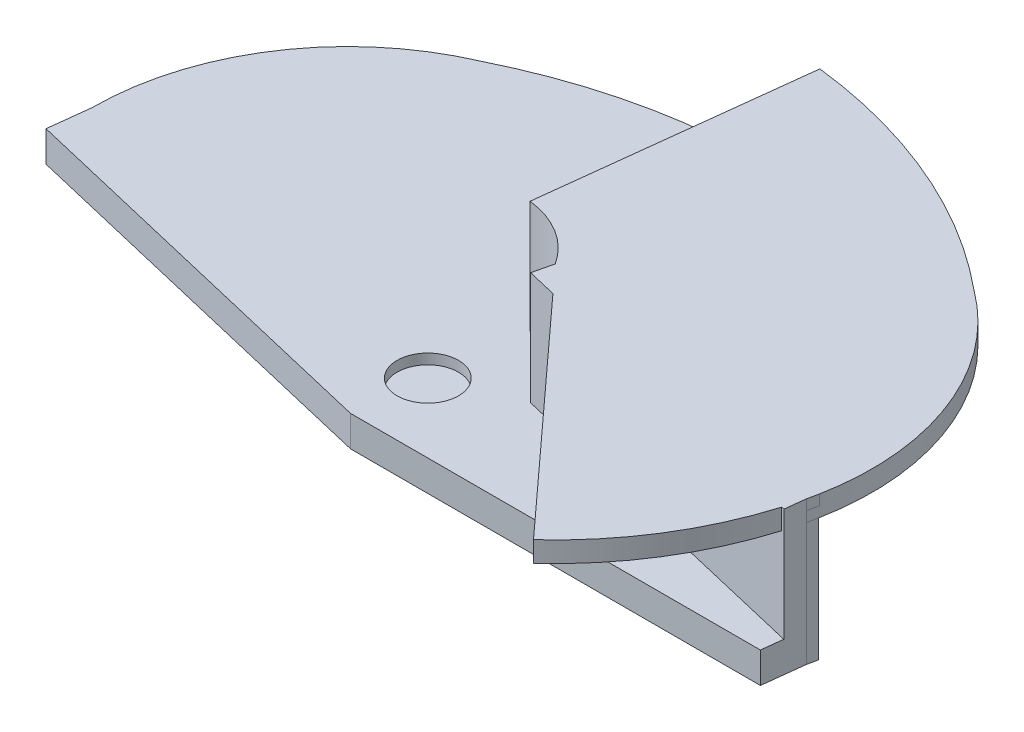
ISO-10303-21;
HEADER;
FILE_DESCRIPTION(('STEP AP214'),'2;1');
FILE_NAME('part.step','',(''),(''),'','','');
FILE_SCHEMA(('AUTOMOTIVE_DESIGN { 1 0 10303 214 1 1 1 1 }'));
ENDSEC;
DATA;
#1=APPLICATION_CONTEXT('core data for automotive mechanical design processes');
#2=APPLICATION_PROTOCOL_DEFINITION('international standard','automotive_design',2000,#1);
#3=PRODUCT_CONTEXT('',#1,'mechanical');
#4=PRODUCT('Part','Part','',(#3));
#5=PRODUCT_RELATED_PRODUCT_CATEGORY('part','',(#4));
#6=PRODUCT_DEFINITION_FORMATION('','',#4);
#7=PRODUCT_DEFINITION_CONTEXT('part definition',#1,'design');
#8=PRODUCT_DEFINITION('design','',#6,#7);
#9=PRODUCT_DEFINITION_SHAPE('','',#8);
#10=(LENGTH_UNIT() NAMED_UNIT(*) SI_UNIT(.MILLI.,.METRE.));
#11=(NAMED_UNIT(*) PLANE_ANGLE_UNIT() SI_UNIT($,.RADIAN.));
#12=(NAMED_UNIT(*) SI_UNIT($,.STERADIAN.) SOLID_ANGLE_UNIT());
#13=UNCERTAINTY_MEASURE_WITH_UNIT(LENGTH_MEASURE(1.E-05),#10,'distance_accuracy_value','');
#14=(GEOMETRIC_REPRESENTATION_CONTEXT(3) GLOBAL_UNCERTAINTY_ASSIGNED_CONTEXT((#13)) GLOBAL_UNIT_ASSIGNED_CONTEXT((#10,
#11,#12)) REPRESENTATION_CONTEXT('',''));
#15=CARTESIAN_POINT('',(0.,0.,0.));
#16=DIRECTION('',(0.,0.,1.));
#17=DIRECTION('',(1.,0.,0.));
#18=AXIS2_PLACEMENT_3D('',#15,#16,#17);
#19=CARTESIAN_POINT('',(43.6601532391621,5.,-13.1517701172031));
#20=DIRECTION('',(0.,1.,0.));
#21=DIRECTION('',(-1.,0.,0.));
#22=AXIS2_PLACEMENT_3D('',#19,#20,#21);
#23=PLANE('',#22);
#24=CARTESIAN_POINT('',(27.3280369120115,5.,1.73227452102643));
#25=DIRECTION('',(0.,1.,0.));
#26=DIRECTION('',(0.981619167562047,0.,0.190850228909461));
#27=AXIS2_PLACEMENT_3D('',#24,#25,#26);
#28=CIRCLE('',#27,12.47);
#29=CARTESIAN_POINT('',(39.5684174931939,5.,4.11208922213855));
#30=VERTEX_POINT('',#29);
#31=CARTESIAN_POINT('',(39.5767492396807,5.,4.07106615646638));
#32=VERTEX_POINT('',#31);
#33=EDGE_CURVE('E52',#30,#32,#28,.T.);
#34=ORIENTED_EDGE('',*,*,#33,.F.);
#35=DIRECTION('',(-0.973178872777088,0.,-0.230049737188105));
#36=VECTOR('',#35,1.);
#37=CARTESIAN_POINT('',(39.5785792060163,5.,4.1145031039015));
#38=LINE('',#37,#36);
#39=CARTESIAN_POINT('',(23.5211278051943,5.,0.318682440297762));
#40=VERTEX_POINT('',#39);
#41=EDGE_CURVE('E258',#30,#40,#38,.T.);
#42=ORIENTED_EDGE('',*,*,#41,.T.);
#43=DIRECTION('',(-0.230049737188105,0.,0.973178872777088));
#44=VECTOR('',#43,1.);
#45=CARTESIAN_POINT('',(27.6027018383401,5.,-16.9475907808068));
#46=LINE('',#45,#44);
#47=CARTESIAN_POINT('',(26.6194622316771,5.,-12.7881945398985));
#48=VERTEX_POINT('',#47);
#49=EDGE_CURVE('E274',#48,#40,#46,.T.);
#50=ORIENTED_EDGE('',*,*,#49,.F.);
#51=CARTESIAN_POINT('',(18.7047366417437,5.,11.1097118581097));
#52=DIRECTION('',(0.,1.,0.));
#53=DIRECTION('',(-1.,0.,0.));
#54=AXIS2_PLACEMENT_3D('',#51,#52,#53);
#55=CIRCLE('',#54,25.1744475882175);
#56=CARTESIAN_POINT('',(34.7538184625354,5.,-8.2856428455672));
#57=VERTEX_POINT('',#56);
#58=EDGE_CURVE('E327',#57,#48,#55,.T.);
#59=ORIENTED_EDGE('',*,*,#58,.F.);
#60=CARTESIAN_POINT('',(27.3280369120115,5.,1.73227452102643));
#61=DIRECTION('',(0.,1.,0.));
#62=DIRECTION('',(-1.,0.,0.));
#63=AXIS2_PLACEMENT_3D('',#60,#61,#62);
#64=CIRCLE('',#63,12.47);
#65=EDGE_CURVE('E283',#32,#57,#64,.T.);
#66=ORIENTED_EDGE('',*,*,#65,.F.);
#67=EDGE_LOOP('',(#34,#42,#50,#59,#66));
#68=FACE_BOUND('',#67,.T.);
#69=ADVANCED_FACE('F35',(#68),#23,.F.);
#70=DIRECTION('',(0.67418029901007,0.,0.738566804308651));
#71=VECTOR('',#70,1.);
#72=CARTESIAN_POINT('',(23.4061260547198,5.,0.805174080158367));
#73=LINE('',#72,#71);
#74=CARTESIAN_POINT('',(24.6014874087827,5.,2.1146964980644));
#75=VERTEX_POINT('',#74);
#76=CARTESIAN_POINT('',(34.530100988386,5.,12.9915263512511));
#77=VERTEX_POINT('',#76);
#78=EDGE_CURVE('E266',#75,#77,#73,.T.);
#79=ORIENTED_EDGE('',*,*,#78,.F.);
#80=DIRECTION('',(0.973271942676288,0.,0.229655667465717));
#81=VECTOR('',#80,1.);
#82=CARTESIAN_POINT('',(39.2426451216094,5.,5.56946047468136));
#83=LINE('',#82,#81);
#84=CARTESIAN_POINT('',(39.2059372433319,5.,5.56079879245524));
#85=VERTEX_POINT('',#84);
#86=EDGE_CURVE('E598',#75,#85,#83,.T.);
#87=ORIENTED_EDGE('',*,*,#86,.T.);
#88=CARTESIAN_POINT('',(23.4061260547198,5.,0.805174080158367));
#89=DIRECTION('',(0.,1.,0.));
#90=DIRECTION('',(0.,0.,-1.));
#91=AXIS2_PLACEMENT_3D('',#88,#89,#90);
#92=CIRCLE('',#91,16.5);
#93=EDGE_CURVE('E271',#77,#85,#92,.T.);
#94=ORIENTED_EDGE('',*,*,#93,.F.);
#95=EDGE_LOOP('',(#79,#87,#94));
#96=FACE_BOUND('',#95,.T.);
#97=ADVANCED_FACE('F329',(#96),#23,.F.);
#98=CARTESIAN_POINT('',(19.6221739397607,0.,3.24068355287576));
#99=DIRECTION('',(0.,1.,0.));
#100=DIRECTION('',(0.,0.,1.));
#101=AXIS2_PLACEMENT_3D('',#98,#99,#100);
#102=CYLINDRICAL_SURFACE('',#101,4.5);
#103=CARTESIAN_POINT('',(19.6221739397607,0.5,3.24068355287576));
#104=DIRECTION('',(0.,-1.,0.));
#105=DIRECTION('',(0.,0.,-1.));
#106=AXIS2_PLACEMENT_3D('',#103,#104,#105);
#107=CIRCLE('',#106,4.5);
#108=CARTESIAN_POINT('',(23.4061260547198,0.5,0.80517408015837));
#109=VERTEX_POINT('',#108);
#110=CARTESIAN_POINT('',(20.1432918852701,0.5,-1.22904083313151));
#111=VERTEX_POINT('',#110);
#112=EDGE_CURVE('E718',#109,#111,#107,.F.);
#113=ORIENTED_EDGE('',*,*,#112,.F.);
#114=DIRECTION('',(0.,1.,0.));
#115=VECTOR('',#114,1.);
#116=CARTESIAN_POINT('',(23.4061260547198,0.,0.805174080158367));
#117=LINE('',#116,#115);
#118=CARTESIAN_POINT('',(23.4061260547198,6.,0.805174080158366));
#119=VERTEX_POINT('',#118);
#120=EDGE_CURVE('E680',#109,#119,#117,.T.);
#121=ORIENTED_EDGE('',*,*,#120,.T.);
#122=CARTESIAN_POINT('',(19.6221739397607,6.,3.24068355287576));
#123=DIRECTION('',(0.,-1.,0.));
#124=DIRECTION('',(0.,0.,1.));
#125=AXIS2_PLACEMENT_3D('',#122,#123,#124);
#126=CIRCLE('',#125,4.5);
#127=CARTESIAN_POINT('',(20.1432918852701,6.,-1.22904083313151));
#128=VERTEX_POINT('',#127);
#129=EDGE_CURVE('E704',#128,#119,#126,.T.);
#130=ORIENTED_EDGE('',*,*,#129,.F.);
#131=DIRECTION('',(0.,-1.,0.));
#132=VECTOR('',#131,1.);
#133=CARTESIAN_POINT('',(20.1432918852701,5.5,-1.22904083313151));
#134=LINE('',#133,#132);
#135=EDGE_CURVE('E674',#128,#111,#134,.T.);
#136=ORIENTED_EDGE('',*,*,#135,.T.);
#137=EDGE_LOOP('',(#113,#121,#130,#136));
#138=FACE_BOUND('',#137,.T.);
#139=ADVANCED_FACE('F339',(#138),#102,.F.);
#140=CARTESIAN_POINT('',(12.47,0.5,0.));
#141=DIRECTION('',(0.,-1.,0.));
#142=DIRECTION('',(0.,0.,-1.));
#143=AXIS2_PLACEMENT_3D('',#140,#141,#142);
#144=CYLINDRICAL_SURFACE('',#143,12.47);
#145=DIRECTION('',(0.,-1.,0.));
#146=VECTOR('',#145,1.);
#147=CARTESIAN_POINT('',(7.54800553852922,0.5,-11.4575246245099));
#148=LINE('',#147,#146);
#149=CARTESIAN_POINT('',(7.54800553852922,0.5,-11.4575246245099));
#150=VERTEX_POINT('',#149);
#151=CARTESIAN_POINT('',(7.54800553852922,-1.,-11.4575246245099));
#152=VERTEX_POINT('',#151);
#153=EDGE_CURVE('E687',#150,#152,#148,.T.);
#154=ORIENTED_EDGE('',*,*,#153,.T.);
#155=CARTESIAN_POINT('',(12.47,-1.,0.));
#156=DIRECTION('',(0.,-1.,0.));
#157=DIRECTION('',(0.,0.,-1.));
#158=AXIS2_PLACEMENT_3D('',#155,#156,#157);
#159=CIRCLE('',#158,12.47);
#160=CARTESIAN_POINT('',(0.,-1.,0.));
#161=VERTEX_POINT('',#160);
#162=EDGE_CURVE('E622',#161,#152,#159,.T.);
#163=ORIENTED_EDGE('',*,*,#162,.F.);
#164=DIRECTION('',(0.,-1.,0.));
#165=VECTOR('',#164,1.);
#166=CARTESIAN_POINT('',(0.,0.5,0.));
#167=LINE('',#166,#165);
#168=CARTESIAN_POINT('',(0.,0.5,0.));
#169=VERTEX_POINT('',#168);
#170=EDGE_CURVE('E691',#169,#161,#167,.T.);
#171=ORIENTED_EDGE('',*,*,#170,.F.);
#172=CARTESIAN_POINT('',(12.47,0.5,0.));
#173=DIRECTION('',(0.,1.,0.));
#174=DIRECTION('',(0.,0.,1.));
#175=AXIS2_PLACEMENT_3D('',#172,#173,#174);
#176=CIRCLE('',#175,12.47);
#177=EDGE_CURVE('E682',#150,#169,#176,.T.);
#178=ORIENTED_EDGE('',*,*,#177,.F.);
#179=EDGE_LOOP('',(#154,#163,#171,#178));
#180=FACE_BOUND('',#179,.T.);
#181=ADVANCED_FACE('F37',(#180),#144,.T.);
#182=CARTESIAN_POINT('',(27.3280369120115,0.5,1.73227452102643));
#183=DIRECTION('',(0.,-1.,0.));
#184=DIRECTION('',(0.,0.,-1.));
#185=AXIS2_PLACEMENT_3D('',#182,#183,#184);
#186=CYLINDRICAL_SURFACE('',#185,12.47);
#187=CARTESIAN_POINT('',(27.3280369120115,5.,1.73227452102643));
#188=DIRECTION('',(0.,1.,0.));
#189=DIRECTION('',(0.973178872777088,0.,0.230049737188105));
#190=AXIS2_PLACEMENT_3D('',#187,#188,#189);
#191=CIRCLE('',#190,12.47);
#192=CARTESIAN_POINT('',(39.4635774555418,5.,4.60099474376211));
#193=VERTEX_POINT('',#192);
#194=EDGE_CURVE('E294',#193,#30,#191,.T.);
#195=ORIENTED_EDGE('',*,*,#194,.T.);
#196=ORIENTED_EDGE('',*,*,#33,.T.);
#197=ORIENTED_EDGE('',*,*,#65,.T.);
#198=DIRECTION('',(0.,-1.,0.));
#199=VECTOR('',#198,1.);
#200=CARTESIAN_POINT('',(34.7538184625354,0.5,-8.2856428455672));
#201=LINE('',#200,#199);
#202=CARTESIAN_POINT('',(34.7538184625354,6.,-8.2856428455672));
#203=VERTEX_POINT('',#202);
#204=EDGE_CURVE('E689',#203,#57,#201,.T.);
#205=ORIENTED_EDGE('',*,*,#204,.F.);
#206=CARTESIAN_POINT('',(27.3280369120115,6.,1.73227452102643));
#207=DIRECTION('',(0.,1.,0.));
#208=DIRECTION('',(0.,0.,1.));
#209=AXIS2_PLACEMENT_3D('',#206,#207,#208);
#210=CIRCLE('',#209,12.47);
#211=CARTESIAN_POINT('',(39.5767492396807,6.,4.07106615646663));
#212=VERTEX_POINT('',#211);
#213=EDGE_CURVE('E188',#212,#203,#210,.T.);
#214=ORIENTED_EDGE('',*,*,#213,.F.);
#215=DIRECTION('',(0.,-1.,0.));
#216=VECTOR('',#215,1.);
#217=CARTESIAN_POINT('',(39.5767492396807,6.,4.07106615646663));
#218=LINE('',#217,#216);
#219=CARTESIAN_POINT('',(39.5767492396807,5.5,4.07106615646663));
#220=VERTEX_POINT('',#219);
#221=EDGE_CURVE('E184',#212,#220,#218,.T.);
#222=ORIENTED_EDGE('',*,*,#221,.T.);
#223=CARTESIAN_POINT('',(39.4635774555418,5.5,4.60099474376211));
#224=DIRECTION('',(0.208850900594595,0.,-0.977947494153355));
#225=VECTOR('',#224,1.);
#226=LINE('',#223,#225);
#227=CARTESIAN_POINT('',(39.4635774555418,5.5,4.60099474376211));
#228=VERTEX_POINT('',#227);
#229=EDGE_CURVE('E44',#228,#220,#226,.T.);
#230=ORIENTED_EDGE('',*,*,#229,.F.);
#231=DIRECTION('',(0.,-1.,0.));
#232=VECTOR('',#231,1.);
#233=CARTESIAN_POINT('',(39.4635774555418,0.5,4.6009947437621));
#234=LINE('',#233,#232);
#235=EDGE_CURVE('E202',#228,#193,#234,.T.);
#236=ORIENTED_EDGE('',*,*,#235,.T.);
#237=EDGE_LOOP('',(#195,#196,#197,#205,#214,#222,#230,#236));
#238=FACE_BOUND('',#237,.T.);
#239=ADVANCED_FACE('F300',(#238),#186,.T.);
#240=CARTESIAN_POINT('',(18.7047366417437,0.5,11.1097118581097));
#241=DIRECTION('',(0.,-1.,0.));
#242=DIRECTION('',(0.,0.,-1.));
#243=AXIS2_PLACEMENT_3D('',#240,#241,#242);
#244=CYLINDRICAL_SURFACE('',#243,25.1744475882175);
#245=ORIENTED_EDGE('',*,*,#58,.T.);
#246=DIRECTION('',(0.,-1.,0.));
#247=VECTOR('',#246,1.);
#248=CARTESIAN_POINT('',(26.6194622316771,0.5,-12.7881945398985));
#249=LINE('',#248,#247);
#250=CARTESIAN_POINT('',(26.6194622316771,-1.,-12.7881945398985));
#251=VERTEX_POINT('',#250);
#252=EDGE_CURVE('E281',#48,#251,#249,.T.);
#253=ORIENTED_EDGE('',*,*,#252,.T.);
#254=CARTESIAN_POINT('',(18.7047366417437,-1.,11.1097118581097));
#255=DIRECTION('',(0.,-1.,0.));
#256=DIRECTION('',(0.,0.,-1.));
#257=AXIS2_PLACEMENT_3D('',#254,#255,#256);
#258=CIRCLE('',#257,25.1744475882175);
#259=EDGE_CURVE('E625',#152,#251,#258,.T.);
#260=ORIENTED_EDGE('',*,*,#259,.F.);
#261=ORIENTED_EDGE('',*,*,#153,.F.);
#262=CARTESIAN_POINT('',(18.7047366417437,0.5,11.1097118581097));
#263=DIRECTION('',(0.,1.,0.));
#264=DIRECTION('',(0.,0.,-1.));
#265=AXIS2_PLACEMENT_3D('',#262,#263,#264);
#266=CIRCLE('',#265,25.1744475882175);
#267=CARTESIAN_POINT('',(21.6200380654119,0.5,-13.8953642061831));
#268=VERTEX_POINT('',#267);
#269=EDGE_CURVE('E685',#268,#150,#266,.T.);
#270=ORIENTED_EDGE('',*,*,#269,.F.);
#271=DIRECTION('',(0.,-1.,0.));
#272=VECTOR('',#271,1.);
#273=CARTESIAN_POINT('',(21.6200380654119,5.5,-13.8953642061831));
#274=LINE('',#273,#272);
#275=CARTESIAN_POINT('',(21.6200380654119,6.,-13.8953642061831));
#276=VERTEX_POINT('',#275);
#277=EDGE_CURVE('E677',#276,#268,#274,.T.);
#278=ORIENTED_EDGE('',*,*,#277,.F.);
#279=CARTESIAN_POINT('',(18.7047366417437,6.,11.1097118581097));
#280=DIRECTION('',(0.,1.,0.));
#281=DIRECTION('',(0.,0.,1.));
#282=AXIS2_PLACEMENT_3D('',#279,#280,#281);
#283=CIRCLE('',#282,25.1744475882175);
#284=EDGE_CURVE('E697',#203,#276,#283,.T.);
#285=ORIENTED_EDGE('',*,*,#284,.F.);
#286=ORIENTED_EDGE('',*,*,#204,.T.);
#287=EDGE_LOOP('',(#245,#253,#260,#261,#270,#278,#285,#286));
#288=FACE_BOUND('',#287,.T.);
#289=ADVANCED_FACE('F309',(#288),#244,.T.);
#290=CARTESIAN_POINT('',(12.47,0.5,0.));
#291=DIRECTION('',(0.,1.,0.));
#292=DIRECTION('',(0.,0.,1.));
#293=AXIS2_PLACEMENT_3D('',#290,#291,#292);
#294=PLANE('',#293);
#295=DIRECTION('',(0.973271942676288,0.,0.229655667465717));
#296=VECTOR('',#295,1.);
#297=CARTESIAN_POINT('',(12.6371640797238,0.5,-0.708434981874455));
#298=LINE('',#297,#296);
#299=CARTESIAN_POINT('',(23.1760763175317,0.5,1.77835295293546));
#300=VERTEX_POINT('',#299);
#301=CARTESIAN_POINT('',(39.3477735425817,0.5,5.59426683827757));
#302=VERTEX_POINT('',#301);
#303=EDGE_CURVE('E267',#300,#302,#298,.T.);
#304=ORIENTED_EDGE('',*,*,#303,.F.);
#305=DIRECTION('',(-0.230049737188105,0.,0.973178872777088));
#306=VECTOR('',#305,1.);
#307=CARTESIAN_POINT('',(23.00761675642,0.5,2.49098704587134));
#308=LINE('',#307,#306);
#309=EDGE_CURVE('E648',#109,#300,#308,.T.);
#310=ORIENTED_EDGE('',*,*,#309,.F.);
#311=ORIENTED_EDGE('',*,*,#112,.T.);
#312=DIRECTION('',(-0.115803987890987,0.,0.993272085779392));
#313=VECTOR('',#312,1.);
#314=CARTESIAN_POINT('',(20.1432918852701,0.5,-1.22904083313151));
#315=LINE('',#314,#313);
#316=EDGE_CURVE('E61',#268,#111,#315,.T.);
#317=ORIENTED_EDGE('',*,*,#316,.F.);
#318=ORIENTED_EDGE('',*,*,#269,.T.);
#319=ORIENTED_EDGE('',*,*,#177,.T.);
#320=DIRECTION('',(0.115803912960101,0.,-0.99327209451546));
#321=VECTOR('',#320,1.);
#322=CARTESIAN_POINT('',(0.,0.5,0.));
#323=LINE('',#322,#321);
#324=CARTESIAN_POINT('',(-0.235136985571462,0.5,2.01681445977638));
#325=VERTEX_POINT('',#324);
#326=EDGE_CURVE('E716',#325,#169,#323,.T.);
#327=ORIENTED_EDGE('',*,*,#326,.F.);
#328=DIRECTION('',(-0.973178879087719,0.,-0.230049710492258));
#329=VECTOR('',#328,1.);
#330=CARTESIAN_POINT('',(-0.463967575910602,0.5,1.96272120704504));
#331=LINE('',#330,#329);
#332=CARTESIAN_POINT('',(19.2284405961829,0.5,6.61780866962153));
#333=VERTEX_POINT('',#332);
#334=EDGE_CURVE('E711',#333,#325,#331,.T.);
#335=ORIENTED_EDGE('',*,*,#334,.F.);
#336=DIRECTION('',(1.,0.,-2.7431600914396E-08));
#337=VECTOR('',#336,1.);
#338=CARTESIAN_POINT('',(1.81537100822149E-07,0.5,6.61780919708843));
#339=LINE('',#338,#337);
#340=CARTESIAN_POINT('',(39.2284405961829,0.5,6.61780812098951));
#341=VERTEX_POINT('',#340);
#342=EDGE_CURVE('E664',#333,#341,#339,.T.);
#343=ORIENTED_EDGE('',*,*,#342,.T.);
#344=DIRECTION('',(-0.115803912960077,0.,0.993272094515463));
#345=VECTOR('',#344,1.);
#346=CARTESIAN_POINT('',(39.4635778026335,0.5,4.60099176669082));
#347=LINE('',#346,#345);
#348=EDGE_CURVE('E710',#302,#341,#347,.T.);
#349=ORIENTED_EDGE('',*,*,#348,.F.);
#350=EDGE_LOOP('',(#304,#310,#311,#317,#318,#319,#327,#335,#343,#349));
#351=FACE_BOUND('',#350,.T.);
#352=CARTESIAN_POINT('',(19.6221740623723,0.5,3.24068356717086));
#353=DIRECTION('',(0.,-1.,0.));
#354=DIRECTION('',(0.,0.,-1.));
#355=AXIS2_PLACEMENT_3D('',#352,#353,#354);
#356=CIRCLE('',#355,1.5);
#357=CARTESIAN_POINT('',(19.6221740623723,0.5,1.74068356717085));
#358=VERTEX_POINT('',#357);
#359=EDGE_CURVE('E286',#358,#358,#356,.T.);
#360=ORIENTED_EDGE('',*,*,#359,.T.);
#361=EDGE_LOOP('',(#360));
#362=FACE_BOUND('',#361,.T.);
#363=ADVANCED_FACE('F364',(#351,#362),#294,.T.);
#364=CARTESIAN_POINT('',(20.1432918852701,5.5,-1.22904083313151));
#365=DIRECTION('',(0.993272085779392,0.,0.115803987890987));
#366=DIRECTION('',(0.115803987890987,0.,-0.993272085779392));
#367=AXIS2_PLACEMENT_3D('',#364,#365,#366);
#368=PLANE('',#367);
#369=ORIENTED_EDGE('',*,*,#316,.T.);
#370=ORIENTED_EDGE('',*,*,#135,.F.);
#371=DIRECTION('',(-0.115803987890987,0.,0.993272085779392));
#372=VECTOR('',#371,1.);
#373=CARTESIAN_POINT('',(21.6200380654119,6.,-13.8953642061831));
#374=LINE('',#373,#372);
#375=EDGE_CURVE('E699',#276,#128,#374,.T.);
#376=ORIENTED_EDGE('',*,*,#375,.F.);
#377=ORIENTED_EDGE('',*,*,#277,.T.);
#378=EDGE_LOOP('',(#369,#370,#376,#377));
#379=FACE_BOUND('',#378,.T.);
#380=ADVANCED_FACE('F347',(#379),#368,.F.);
#381=CARTESIAN_POINT('',(0.,0.5,0.));
#382=DIRECTION('',(-0.99327209451546,0.,-0.115803912960101));
#383=DIRECTION('',(-0.115803912960101,0.,0.99327209451546));
#384=AXIS2_PLACEMENT_3D('',#381,#382,#383);
#385=PLANE('',#384);
#386=ORIENTED_EDGE('',*,*,#170,.T.);
#387=DIRECTION('',(0.115803912960102,0.,-0.99327209451546));
#388=VECTOR('',#387,1.);
#389=CARTESIAN_POINT('',(-0.235136985571462,-1.,2.01681445977638));
#390=LINE('',#389,#388);
#391=CARTESIAN_POINT('',(-0.235136985571462,-1.,2.01681445977638));
#392=VERTEX_POINT('',#391);
#393=EDGE_CURVE('E619',#392,#161,#390,.T.);
#394=ORIENTED_EDGE('',*,*,#393,.F.);
#395=DIRECTION('',(0.,-1.,0.));
#396=VECTOR('',#395,1.);
#397=CARTESIAN_POINT('',(-0.235136985571462,0.5,2.01681445977638));
#398=LINE('',#397,#396);
#399=EDGE_CURVE('E667',#325,#392,#398,.T.);
#400=ORIENTED_EDGE('',*,*,#399,.F.);
#401=ORIENTED_EDGE('',*,*,#326,.T.);
#402=EDGE_LOOP('',(#386,#394,#400,#401));
#403=FACE_BOUND('',#402,.T.);
#404=ADVANCED_FACE('F343',(#403),#385,.T.);
#405=CARTESIAN_POINT('',(-0.463967575910602,0.5,1.96272120704504));
#406=DIRECTION('',(-0.230049710492257,0.,0.973178879087719));
#407=DIRECTION('',(0.973178879087719,0.,0.230049710492258));
#408=AXIS2_PLACEMENT_3D('',#405,#406,#407);
#409=PLANE('',#408);
#410=ORIENTED_EDGE('',*,*,#399,.T.);
#411=DIRECTION('',(-0.973178879087719,0.,-0.230049710492257));
#412=VECTOR('',#411,1.);
#413=CARTESIAN_POINT('',(19.2284405961829,-1.,6.61780866962153));
#414=LINE('',#413,#412);
#415=CARTESIAN_POINT('',(19.2284405961829,-1.,6.61780866962153));
#416=VERTEX_POINT('',#415);
#417=EDGE_CURVE('E616',#416,#392,#414,.T.);
#418=ORIENTED_EDGE('',*,*,#417,.F.);
#419=DIRECTION('',(0.,-1.,0.));
#420=VECTOR('',#419,1.);
#421=CARTESIAN_POINT('',(19.2284405961829,0.5,6.61780866962153));
#422=LINE('',#421,#420);
#423=EDGE_CURVE('E662',#333,#416,#422,.T.);
#424=ORIENTED_EDGE('',*,*,#423,.F.);
#425=ORIENTED_EDGE('',*,*,#334,.T.);
#426=EDGE_LOOP('',(#410,#418,#424,#425));
#427=FACE_BOUND('',#426,.T.);
#428=ADVANCED_FACE('F346',(#427),#409,.T.);
#429=CARTESIAN_POINT('',(1.81537100822149E-07,0.5,6.61780919708843));
#430=DIRECTION('',(-2.7431600914396E-08,0.,-1.));
#431=DIRECTION('',(-1.,0.,2.7431600914396E-08));
#432=AXIS2_PLACEMENT_3D('',#429,#430,#431);
#433=PLANE('',#432);
#434=ORIENTED_EDGE('',*,*,#423,.T.);
#435=DIRECTION('',(-1.,0.,2.74316009577641E-08));
#436=VECTOR('',#435,1.);
#437=CARTESIAN_POINT('',(39.2284405961829,-1.,6.61780812098951));
#438=LINE('',#437,#436);
#439=CARTESIAN_POINT('',(39.2284405961829,-1.,6.61780812098951));
#440=VERTEX_POINT('',#439);
#441=EDGE_CURVE('E613',#440,#416,#438,.T.);
#442=ORIENTED_EDGE('',*,*,#441,.F.);
#443=DIRECTION('',(0.,-1.,0.));
#444=VECTOR('',#443,1.);
#445=CARTESIAN_POINT('',(39.2284405961829,0.5,6.61780812098951));
#446=LINE('',#445,#444);
#447=EDGE_CURVE('E661',#341,#440,#446,.T.);
#448=ORIENTED_EDGE('',*,*,#447,.F.);
#449=ORIENTED_EDGE('',*,*,#342,.F.);
#450=EDGE_LOOP('',(#434,#442,#448,#449));
#451=FACE_BOUND('',#450,.T.);
#452=ADVANCED_FACE('F351',(#451),#433,.F.);
#453=CARTESIAN_POINT('',(19.6221740623723,0.5,3.24068356717086));
#454=DIRECTION('',(0.,-1.,0.));
#455=DIRECTION('',(0.,0.,-1.));
#456=AXIS2_PLACEMENT_3D('',#453,#454,#455);
#457=CYLINDRICAL_SURFACE('',#456,1.5);
#458=ORIENTED_EDGE('',*,*,#359,.F.);
#459=EDGE_LOOP('',(#458));
#460=FACE_BOUND('',#459,.T.);
#461=CARTESIAN_POINT('',(19.6221740623723,0.,3.24068356717086));
#462=DIRECTION('',(0.,-1.,0.));
#463=DIRECTION('',(0.,0.,-1.));
#464=AXIS2_PLACEMENT_3D('',#461,#462,#463);
#465=CIRCLE('',#464,1.5);
#466=CARTESIAN_POINT('',(19.6221740623723,0.,1.74068356717085));
#467=VERTEX_POINT('',#466);
#468=EDGE_CURVE('E634',#467,#467,#465,.T.);
#469=ORIENTED_EDGE('',*,*,#468,.T.);
#470=EDGE_LOOP('',(#469));
#471=FACE_BOUND('',#470,.T.);
#472=ADVANCED_FACE('F355',(#460,#471),#457,.F.);
#473=CARTESIAN_POINT('',(39.4635778026335,0.5,4.60099176669082));
#474=DIRECTION('',(0.993272094515463,0.,0.115803912960077));
#475=DIRECTION('',(0.115803912960077,0.,-0.993272094515463));
#476=AXIS2_PLACEMENT_3D('',#473,#474,#475);
#477=PLANE('',#476);
#478=ORIENTED_EDGE('',*,*,#447,.T.);
#479=DIRECTION('',(-0.115803912960084,0.,0.993272094515462));
#480=VECTOR('',#479,1.);
#481=CARTESIAN_POINT('',(39.4635774555418,-1.,4.60099474376211));
#482=LINE('',#481,#480);
#483=CARTESIAN_POINT('',(39.4635774555418,-1.,4.60099474376211));
#484=VERTEX_POINT('',#483);
#485=EDGE_CURVE('E207',#484,#440,#482,.T.);
#486=ORIENTED_EDGE('',*,*,#485,.F.);
#487=DIRECTION('',(0.,-1.,0.));
#488=VECTOR('',#487,1.);
#489=CARTESIAN_POINT('',(39.4635774555418,0.5,4.6009947437621));
#490=LINE('',#489,#488);
#491=EDGE_CURVE('E322',#193,#484,#490,.T.);
#492=ORIENTED_EDGE('',*,*,#491,.F.);
#493=ORIENTED_EDGE('',*,*,#235,.F.);
#494=DIRECTION('',(0.,-1.,0.));
#495=VECTOR('',#494,1.);
#496=CARTESIAN_POINT('',(39.4635774555418,6.,4.60099474376211));
#497=LINE('',#496,#495);
#498=CARTESIAN_POINT('',(39.4635774555418,6.,4.60099474376211));
#499=VERTEX_POINT('',#498);
#500=EDGE_CURVE('E181',#499,#228,#497,.T.);
#501=ORIENTED_EDGE('',*,*,#500,.F.);
#502=DIRECTION('',(0.115803912960087,0.,-0.993272094515462));
#503=VECTOR('',#502,1.);
#504=CARTESIAN_POINT('',(39.3477735425817,6.,5.59426683827757));
#505=LINE('',#504,#503);
#506=CARTESIAN_POINT('',(39.3477735425817,6.,5.59426683827757));
#507=VERTEX_POINT('',#506);
#508=EDGE_CURVE('E189',#507,#499,#505,.T.);
#509=ORIENTED_EDGE('',*,*,#508,.F.);
#510=DIRECTION('',(0.,-1.,0.));
#511=VECTOR('',#510,1.);
#512=CARTESIAN_POINT('',(39.3477735425817,22.7207423614323,5.59426683827757));
#513=LINE('',#512,#511);
#514=EDGE_CURVE('E639',#507,#302,#513,.T.);
#515=ORIENTED_EDGE('',*,*,#514,.T.);
#516=ORIENTED_EDGE('',*,*,#348,.T.);
#517=EDGE_LOOP('',(#478,#486,#492,#493,#501,#509,#515,#516));
#518=FACE_BOUND('',#517,.T.);
#519=ADVANCED_FACE('F200',(#518),#477,.T.);
#520=CARTESIAN_POINT('',(27.6027018383401,0.,-16.9475907808068));
#521=DIRECTION('',(-0.973178872777088,0.,-0.230049737188105));
#522=DIRECTION('',(-0.230049737188105,0.,0.973178872777088));
#523=AXIS2_PLACEMENT_3D('',#520,#521,#522);
#524=PLANE('',#523);
#525=ORIENTED_EDGE('',*,*,#49,.T.);
#526=DIRECTION('',(0.,-1.,0.));
#527=VECTOR('',#526,1.);
#528=CARTESIAN_POINT('',(23.5211278051943,22.7207423614323,0.318682440297762));
#529=LINE('',#528,#527);
#530=CARTESIAN_POINT('',(23.5211278051943,-1.,0.318682440297762));
#531=VERTEX_POINT('',#530);
#532=EDGE_CURVE('E638',#40,#531,#529,.T.);
#533=ORIENTED_EDGE('',*,*,#532,.T.);
#534=DIRECTION('',(-0.230049737188106,0.,0.973178872777088));
#535=VECTOR('',#534,1.);
#536=CARTESIAN_POINT('',(26.6194622316771,-1.,-12.7881945398985));
#537=LINE('',#536,#535);
#538=EDGE_CURVE('E628',#251,#531,#537,.T.);
#539=ORIENTED_EDGE('',*,*,#538,.F.);
#540=ORIENTED_EDGE('',*,*,#252,.F.);
#541=EDGE_LOOP('',(#525,#533,#539,#540));
#542=FACE_BOUND('',#541,.T.);
#543=ADVANCED_FACE('F341',(#542),#524,.F.);
#544=CARTESIAN_POINT('',(23.4061260547198,5.,0.805174080158367));
#545=DIRECTION('',(0.,1.,0.));
#546=DIRECTION('',(0.,0.,1.));
#547=AXIS2_PLACEMENT_3D('',#544,#545,#546);
#548=CYLINDRICAL_SURFACE('',#547,16.5);
#549=DIRECTION('',(0.,1.,0.));
#550=VECTOR('',#549,1.);
#551=CARTESIAN_POINT('',(39.2059372433319,5.,5.56079879245524));
#552=LINE('',#551,#550);
#553=CARTESIAN_POINT('',(39.2059372433319,6.,5.56079879245524));
#554=VERTEX_POINT('',#553);
#555=EDGE_CURVE('E600',#554,#85,#552,.F.);
#556=ORIENTED_EDGE('',*,*,#555,.F.);
#557=CARTESIAN_POINT('',(23.4061260547198,6.,0.805174080158367));
#558=DIRECTION('',(0.,1.,0.));
#559=DIRECTION('',(0.,0.,1.));
#560=AXIS2_PLACEMENT_3D('',#557,#558,#559);
#561=CIRCLE('',#560,16.5);
#562=CARTESIAN_POINT('',(34.530100988386,6.,12.9915263512511));
#563=VERTEX_POINT('',#562);
#564=EDGE_CURVE('E601',#563,#554,#561,.T.);
#565=ORIENTED_EDGE('',*,*,#564,.F.);
#566=DIRECTION('',(0.,1.,0.));
#567=VECTOR('',#566,1.);
#568=CARTESIAN_POINT('',(34.530100988386,5.,12.9915263512511));
#569=LINE('',#568,#567);
#570=EDGE_CURVE('E272',#77,#563,#569,.T.);
#571=ORIENTED_EDGE('',*,*,#570,.F.);
#572=ORIENTED_EDGE('',*,*,#93,.T.);
#573=EDGE_LOOP('',(#556,#565,#571,#572));
#574=FACE_BOUND('',#573,.T.);
#575=ADVANCED_FACE('F432',(#574),#548,.T.);
#576=CARTESIAN_POINT('',(23.4061260547198,5.,0.805174080158367));
#577=DIRECTION('',(-0.738566804308651,0.,0.67418029901007));
#578=DIRECTION('',(0.67418029901007,0.,0.738566804308651));
#579=AXIS2_PLACEMENT_3D('',#576,#577,#578);
#580=PLANE('',#579);
#581=DIRECTION('',(0.,1.,0.));
#582=VECTOR('',#581,1.);
#583=CARTESIAN_POINT('',(24.6014874087827,5.,2.1146964980644));
#584=LINE('',#583,#582);
#585=CARTESIAN_POINT('',(24.6014874087827,6.,2.1146964980644));
#586=VERTEX_POINT('',#585);
#587=EDGE_CURVE('E11',#75,#586,#584,.T.);
#588=ORIENTED_EDGE('',*,*,#587,.F.);
#589=ORIENTED_EDGE('',*,*,#78,.T.);
#590=ORIENTED_EDGE('',*,*,#570,.T.);
#591=DIRECTION('',(0.67418029901007,0.,0.738566804308651));
#592=VECTOR('',#591,1.);
#593=CARTESIAN_POINT('',(24.6014874087827,6.,2.1146964980644));
#594=LINE('',#593,#592);
#595=EDGE_CURVE('E593',#586,#563,#594,.T.);
#596=ORIENTED_EDGE('',*,*,#595,.F.);
#597=EDGE_LOOP('',(#588,#589,#590,#596));
#598=FACE_BOUND('',#597,.T.);
#599=ADVANCED_FACE('F443',(#598),#580,.T.);
#600=CARTESIAN_POINT('',(23.5211278051943,22.7207423614323,0.318682440297762));
#601=DIRECTION('',(0.230049737188105,0.,-0.973178872777088));
#602=DIRECTION('',(-0.973178872777088,0.,-0.230049737188105));
#603=AXIS2_PLACEMENT_3D('',#600,#601,#602);
#604=PLANE('',#603);
#605=ORIENTED_EDGE('',*,*,#41,.F.);
#606=DIRECTION('',(0.,-1.,0.));
#607=VECTOR('',#606,1.);
#608=CARTESIAN_POINT('',(39.5688240048056,22.7207423614323,4.11219707205318));
#609=LINE('',#608,#607);
#610=CARTESIAN_POINT('',(39.5688240048056,-1.,4.11219707205318));
#611=VERTEX_POINT('',#610);
#612=EDGE_CURVE('E641',#30,#611,#609,.T.);
#613=ORIENTED_EDGE('',*,*,#612,.T.);
#614=DIRECTION('',(0.973178872777088,0.,0.230049737188105));
#615=VECTOR('',#614,1.);
#616=CARTESIAN_POINT('',(23.5211278051943,-1.,0.318682440297762));
#617=LINE('',#616,#615);
#618=EDGE_CURVE('E631',#531,#611,#617,.T.);
#619=ORIENTED_EDGE('',*,*,#618,.F.);
#620=ORIENTED_EDGE('',*,*,#532,.F.);
#621=EDGE_LOOP('',(#605,#613,#619,#620));
#622=FACE_BOUND('',#621,.T.);
#623=ADVANCED_FACE('F248',(#622),#604,.T.);
#624=CARTESIAN_POINT('',(39.5688240048056,22.7207423614323,4.11219707205318));
#625=DIRECTION('',(0.97759534341785,0.,0.210493098527567));
#626=DIRECTION('',(0.210493098527567,0.,-0.97759534341785));
#627=AXIS2_PLACEMENT_3D('',#624,#625,#626);
#628=PLANE('',#627);
#629=ORIENTED_EDGE('',*,*,#194,.F.);
#630=ORIENTED_EDGE('',*,*,#491,.T.);
#631=DIRECTION('',(-0.210493098527567,0.,0.97759534341785));
#632=VECTOR('',#631,1.);
#633=CARTESIAN_POINT('',(39.5688240048056,-1.,4.11219707205318));
#634=LINE('',#633,#632);
#635=EDGE_CURVE('E204',#611,#484,#634,.T.);
#636=ORIENTED_EDGE('',*,*,#635,.F.);
#637=ORIENTED_EDGE('',*,*,#612,.F.);
#638=EDGE_LOOP('',(#629,#630,#636,#637));
#639=FACE_BOUND('',#638,.T.);
#640=ADVANCED_FACE('F243',(#639),#628,.T.);
#641=CARTESIAN_POINT('',(39.3477735425817,22.7207423614323,5.59426683827757));
#642=DIRECTION('',(-0.229655667465717,0.,0.973271942676288));
#643=DIRECTION('',(0.973271942676288,0.,0.229655667465717));
#644=AXIS2_PLACEMENT_3D('',#641,#642,#643);
#645=PLANE('',#644);
#646=DIRECTION('',(0.,-1.,0.));
#647=VECTOR('',#646,1.);
#648=CARTESIAN_POINT('',(23.1760763175317,22.7207423614323,1.77835295293546));
#649=LINE('',#648,#647);
#650=CARTESIAN_POINT('',(23.1760763175317,6.,1.77835295293546));
#651=VERTEX_POINT('',#650);
#652=EDGE_CURVE('E635',#651,#300,#649,.T.);
#653=ORIENTED_EDGE('',*,*,#652,.T.);
#654=ORIENTED_EDGE('',*,*,#303,.T.);
#655=ORIENTED_EDGE('',*,*,#514,.F.);
#656=DIRECTION('',(0.973271942676292,0.,0.229655667465699));
#657=VECTOR('',#656,1.);
#658=CARTESIAN_POINT('',(39.2059372433319,6.,5.56079879245524));
#659=LINE('',#658,#657);
#660=EDGE_CURVE('E196',#554,#507,#659,.T.);
#661=ORIENTED_EDGE('',*,*,#660,.F.);
#662=ORIENTED_EDGE('',*,*,#555,.T.);
#663=ORIENTED_EDGE('',*,*,#86,.F.);
#664=ORIENTED_EDGE('',*,*,#587,.T.);
#665=DIRECTION('',(0.973271942676288,0.,0.229655667465717));
#666=VECTOR('',#665,1.);
#667=CARTESIAN_POINT('',(23.1760763175317,6.,1.77835295293546));
#668=LINE('',#667,#666);
#669=EDGE_CURVE('E603',#651,#586,#668,.T.);
#670=ORIENTED_EDGE('',*,*,#669,.F.);
#671=EDGE_LOOP('',(#653,#654,#655,#661,#662,#663,#664,#670));
#672=FACE_BOUND('',#671,.T.);
#673=ADVANCED_FACE('F239',(#672),#645,.T.);
#674=CARTESIAN_POINT('',(23.1760763175317,22.7207423614323,1.77835295293546));
#675=DIRECTION('',(-0.973178872777088,0.,-0.230049737188105));
#676=DIRECTION('',(-0.230049737188105,0.,0.973178872777088));
#677=AXIS2_PLACEMENT_3D('',#674,#675,#676);
#678=PLANE('',#677);
#679=ORIENTED_EDGE('',*,*,#120,.F.);
#680=ORIENTED_EDGE('',*,*,#309,.T.);
#681=ORIENTED_EDGE('',*,*,#652,.F.);
#682=DIRECTION('',(-0.230049737188105,0.,0.973178872777088));
#683=VECTOR('',#682,1.);
#684=CARTESIAN_POINT('',(23.4061260547198,6.,0.805174080158366));
#685=LINE('',#684,#683);
#686=EDGE_CURVE('E606',#119,#651,#685,.T.);
#687=ORIENTED_EDGE('',*,*,#686,.F.);
#688=EDGE_LOOP('',(#679,#680,#681,#687));
#689=FACE_BOUND('',#688,.T.);
#690=ADVANCED_FACE('F235',(#689),#678,.T.);
#691=CARTESIAN_POINT('',(12.47,0.,0.));
#692=DIRECTION('',(0.,-1.,0.));
#693=DIRECTION('',(0.,0.,-1.));
#694=AXIS2_PLACEMENT_3D('',#691,#692,#693);
#695=PLANE('',#694);
#696=ORIENTED_EDGE('',*,*,#468,.F.);
#697=EDGE_LOOP('',(#696));
#698=FACE_BOUND('',#697,.T.);
#699=ADVANCED_FACE('F231',(#698),#695,.F.);
#700=CARTESIAN_POINT('',(12.47,-1.,0.));
#701=DIRECTION('',(0.,-1.,0.));
#702=DIRECTION('',(0.,0.,-1.));
#703=AXIS2_PLACEMENT_3D('',#700,#701,#702);
#704=PLANE('',#703);
#705=ORIENTED_EDGE('',*,*,#635,.T.);
#706=ORIENTED_EDGE('',*,*,#485,.T.);
#707=ORIENTED_EDGE('',*,*,#441,.T.);
#708=ORIENTED_EDGE('',*,*,#417,.T.);
#709=ORIENTED_EDGE('',*,*,#393,.T.);
#710=ORIENTED_EDGE('',*,*,#162,.T.);
#711=ORIENTED_EDGE('',*,*,#259,.T.);
#712=ORIENTED_EDGE('',*,*,#538,.T.);
#713=ORIENTED_EDGE('',*,*,#618,.T.);
#714=EDGE_LOOP('',(#705,#706,#707,#708,#709,#710,#711,#712,#713));
#715=FACE_BOUND('',#714,.T.);
#716=ADVANCED_FACE('F228',(#715),#704,.T.);
#717=CARTESIAN_POINT('',(39.4635774555418,6.,4.60099474376211));
#718=DIRECTION('',(-0.977947494153355,0.,-0.208850900594595));
#719=DIRECTION('',(-0.208850900594595,0.,0.977947494153355));
#720=AXIS2_PLACEMENT_3D('',#717,#718,#719);
#721=PLANE('',#720);
#722=ORIENTED_EDGE('',*,*,#229,.T.);
#723=ORIENTED_EDGE('',*,*,#221,.F.);
#724=DIRECTION('',(0.208850900594595,0.,-0.977947494153355));
#725=VECTOR('',#724,1.);
#726=CARTESIAN_POINT('',(39.4635774555418,6.,4.60099474376211));
#727=LINE('',#726,#725);
#728=EDGE_CURVE('E177',#499,#212,#727,.T.);
#729=ORIENTED_EDGE('',*,*,#728,.F.);
#730=ORIENTED_EDGE('',*,*,#500,.T.);
#731=EDGE_LOOP('',(#722,#723,#729,#730));
#732=FACE_BOUND('',#731,.T.);
#733=ADVANCED_FACE('F179',(#732),#721,.F.);
#734=CARTESIAN_POINT('',(27.3280369120115,6.,1.73227452102643));
#735=DIRECTION('',(0.,1.,0.));
#736=DIRECTION('',(0.,0.,1.));
#737=AXIS2_PLACEMENT_3D('',#734,#735,#736);
#738=PLANE('',#737);
#739=ORIENTED_EDGE('',*,*,#508,.T.);
#740=ORIENTED_EDGE('',*,*,#728,.T.);
#741=ORIENTED_EDGE('',*,*,#213,.T.);
#742=ORIENTED_EDGE('',*,*,#284,.T.);
#743=ORIENTED_EDGE('',*,*,#375,.T.);
#744=ORIENTED_EDGE('',*,*,#129,.T.);
#745=ORIENTED_EDGE('',*,*,#686,.T.);
#746=ORIENTED_EDGE('',*,*,#669,.T.);
#747=ORIENTED_EDGE('',*,*,#595,.T.);
#748=ORIENTED_EDGE('',*,*,#564,.T.);
#749=ORIENTED_EDGE('',*,*,#660,.T.);
#750=EDGE_LOOP('',(#739,#740,#741,#742,#743,#744,#745,#746,#747,#748,#749));
#751=FACE_BOUND('',#750,.T.);
#752=ADVANCED_FACE('F193',(#751),#738,.T.);
#753=CLOSED_SHELL('',(#69,#97,#139,#181,#239,#289,#363,#380,#404,#428,#452,#472,#519,#543,#575,
#599,#623,#640,#673,#690,#699,#716,#733,#752));
#754=MANIFOLD_SOLID_BREP('B2',#753);
#755=ADVANCED_BREP_SHAPE_REPRESENTATION('',(#18,#754),#14);
#756=SHAPE_DEFINITION_REPRESENTATION(#9,#755);
ENDSEC;
END-ISO-10303-21;
